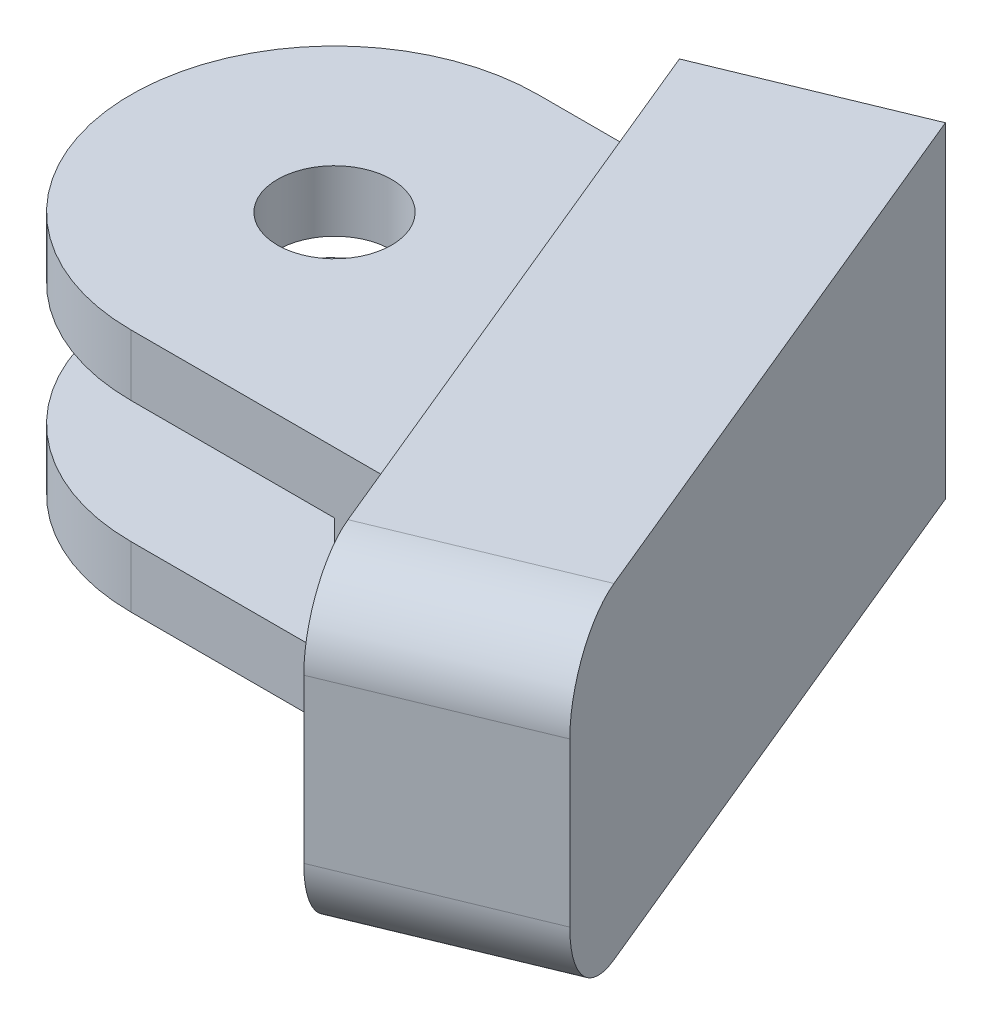
ISO-10303-21;
HEADER;
FILE_DESCRIPTION(('STEP AP214'),'2;1');
FILE_NAME('part.step','',(''),(''),'','','');
FILE_SCHEMA(('AUTOMOTIVE_DESIGN { 1 0 10303 214 1 1 1 1 }'));
ENDSEC;
DATA;
#1=APPLICATION_CONTEXT('core data for automotive mechanical design processes');
#2=APPLICATION_PROTOCOL_DEFINITION('international standard','automotive_design',2000,#1);
#3=PRODUCT_CONTEXT('',#1,'mechanical');
#4=PRODUCT('Part','Part','',(#3));
#5=PRODUCT_RELATED_PRODUCT_CATEGORY('part','',(#4));
#6=PRODUCT_DEFINITION_FORMATION('','',#4);
#7=PRODUCT_DEFINITION_CONTEXT('part definition',#1,'design');
#8=PRODUCT_DEFINITION('design','',#6,#7);
#9=PRODUCT_DEFINITION_SHAPE('','',#8);
#10=(LENGTH_UNIT() NAMED_UNIT(*) SI_UNIT(.MILLI.,.METRE.));
#11=(NAMED_UNIT(*) PLANE_ANGLE_UNIT() SI_UNIT($,.RADIAN.));
#12=(NAMED_UNIT(*) SI_UNIT($,.STERADIAN.) SOLID_ANGLE_UNIT());
#13=UNCERTAINTY_MEASURE_WITH_UNIT(LENGTH_MEASURE(1.E-05),#10,'distance_accuracy_value','');
#14=(GEOMETRIC_REPRESENTATION_CONTEXT(3) GLOBAL_UNCERTAINTY_ASSIGNED_CONTEXT((#13)) GLOBAL_UNIT_ASSIGNED_CONTEXT((#10,
#11,#12)) REPRESENTATION_CONTEXT('',''));
#15=CARTESIAN_POINT('',(0.,0.,0.));
#16=DIRECTION('',(0.,0.,1.));
#17=DIRECTION('',(1.,0.,0.));
#18=AXIS2_PLACEMENT_3D('',#15,#16,#17);
#19=CARTESIAN_POINT('',(0.,0.,0.));
#20=DIRECTION('',(-1.,0.,0.));
#21=DIRECTION('',(0.,0.,1.));
#22=AXIS2_PLACEMENT_3D('',#19,#20,#21);
#23=PLANE('',#22);
#24=DIRECTION('',(0.,0.,-1.));
#25=VECTOR('',#24,1.);
#26=CARTESIAN_POINT('',(0.,1.5,5.));
#27=LINE('',#26,#25);
#28=CARTESIAN_POINT('',(0.,1.5,5.));
#29=VERTEX_POINT('',#28);
#30=CARTESIAN_POINT('',(0.,1.5,3.31662479035541));
#31=VERTEX_POINT('',#30);
#32=EDGE_CURVE('E181',#29,#31,#27,.T.);
#33=ORIENTED_EDGE('',*,*,#32,.T.);
#34=DIRECTION('',(0.,1.,0.));
#35=VECTOR('',#34,1.);
#36=CARTESIAN_POINT('',(0.,-18.4705627484771,3.31662479035541));
#37=LINE('',#36,#35);
#38=CARTESIAN_POINT('',(0.,-1.5,3.31662479035541));
#39=VERTEX_POINT('',#38);
#40=EDGE_CURVE('E174',#31,#39,#37,.F.);
#41=ORIENTED_EDGE('',*,*,#40,.T.);
#42=DIRECTION('',(0.,0.,-1.));
#43=VECTOR('',#42,1.);
#44=CARTESIAN_POINT('',(0.,-1.5,5.));
#45=LINE('',#44,#43);
#46=CARTESIAN_POINT('',(0.,-1.5,5.));
#47=VERTEX_POINT('',#46);
#48=EDGE_CURVE('E172',#47,#39,#45,.T.);
#49=ORIENTED_EDGE('',*,*,#48,.F.);
#50=DIRECTION('',(0.,1.,0.));
#51=VECTOR('',#50,1.);
#52=CARTESIAN_POINT('',(0.,3.,5.));
#53=LINE('',#52,#51);
#54=EDGE_CURVE('E257',#47,#29,#53,.T.);
#55=ORIENTED_EDGE('',*,*,#54,.T.);
#56=EDGE_LOOP('',(#33,#41,#49,#55));
#57=FACE_BOUND('',#56,.T.);
#58=ADVANCED_FACE('F39',(#57),#23,.T.);
#59=CARTESIAN_POINT('',(2.7006271825177,-2.,7.37112643894407));
#60=DIRECTION('',(-0.924244626674477,0.,0.381800825121366));
#61=DIRECTION('',(0.381800825121366,0.,0.924244626674478));
#62=AXIS2_PLACEMENT_3D('',#59,#60,#61);
#63=PLANE('',#62);
#64=DIRECTION('',(0.,1.,0.));
#65=VECTOR('',#64,1.);
#66=CARTESIAN_POINT('',(-3.02638519430278,4.,-6.4925429611731));
#67=LINE('',#66,#65);
#68=CARTESIAN_POINT('',(-3.02638519430278,-4.,-6.4925429611731));
#69=VERTEX_POINT('',#68);
#70=CARTESIAN_POINT('',(-3.02638519430278,4.,-6.4925429611731));
#71=VERTEX_POINT('',#70);
#72=EDGE_CURVE('E296',#69,#71,#67,.T.);
#73=ORIENTED_EDGE('',*,*,#72,.F.);
#74=DIRECTION('',(-0.381800825121366,0.,-0.924244626674477));
#75=VECTOR('',#74,1.);
#76=CARTESIAN_POINT('',(2.7006271825177,-4.,7.37112643894405));
#77=LINE('',#76,#75);
#78=CARTESIAN_POINT('',(2.7006271825177,-4.,7.37112643894405));
#79=VERTEX_POINT('',#78);
#80=EDGE_CURVE('E278',#79,#69,#77,.T.);
#81=ORIENTED_EDGE('',*,*,#80,.F.);
#82=CARTESIAN_POINT('',(2.7006271825177,-2.,7.37112643894407));
#83=DIRECTION('',(0.924244626674477,0.,-0.381800825121366));
#84=DIRECTION('',(0.381800825121366,0.,0.924244626674478));
#85=AXIS2_PLACEMENT_3D('',#82,#83,#84);
#86=CIRCLE('',#85,2.);
#87=CARTESIAN_POINT('',(3.46422883276044,-2.,9.21961569229302));
#88=VERTEX_POINT('',#87);
#89=EDGE_CURVE('E320',#88,#79,#86,.T.);
#90=ORIENTED_EDGE('',*,*,#89,.F.);
#91=DIRECTION('',(0.,-1.,0.));
#92=VECTOR('',#91,1.);
#93=CARTESIAN_POINT('',(3.46422883276044,1.99999999999999,9.21961569229302));
#94=LINE('',#93,#92);
#95=CARTESIAN_POINT('',(3.46422883276044,1.99999999999999,9.21961569229302));
#96=VERTEX_POINT('',#95);
#97=EDGE_CURVE('E324',#96,#88,#94,.T.);
#98=ORIENTED_EDGE('',*,*,#97,.F.);
#99=CARTESIAN_POINT('',(2.70062718251771,2.,7.37112643894407));
#100=DIRECTION('',(0.924244626674477,0.,-0.381800825121366));
#101=DIRECTION('',(0.381800825121366,0.,0.924244626674478));
#102=AXIS2_PLACEMENT_3D('',#99,#100,#101);
#103=CIRCLE('',#102,2.);
#104=CARTESIAN_POINT('',(2.7006271825177,4.,7.37112643894405));
#105=VERTEX_POINT('',#104);
#106=EDGE_CURVE('E328',#105,#96,#103,.T.);
#107=ORIENTED_EDGE('',*,*,#106,.F.);
#108=DIRECTION('',(0.381800825121366,0.,0.924244626674478));
#109=VECTOR('',#108,1.);
#110=CARTESIAN_POINT('',(2.7006271825177,4.,7.37112643894405));
#111=LINE('',#110,#109);
#112=EDGE_CURVE('E332',#71,#105,#111,.T.);
#113=ORIENTED_EDGE('',*,*,#112,.F.);
#114=EDGE_LOOP('',(#73,#81,#90,#98,#107,#113));
#115=FACE_BOUND('',#114,.T.);
#116=DIRECTION('',(0.,1.,0.));
#117=VECTOR('',#116,1.);
#118=CARTESIAN_POINT('',(-2.61949240958185,-18.4705627484771,-5.50755695494487));
#119=LINE('',#118,#117);
#120=CARTESIAN_POINT('',(-2.61949240958185,-1.5,-5.50755695494487));
#121=VERTEX_POINT('',#120);
#122=CARTESIAN_POINT('',(-2.61949240958185,1.5,-5.50755695494487));
#123=VERTEX_POINT('',#122);
#124=EDGE_CURVE('E48',#121,#123,#119,.T.);
#125=ORIENTED_EDGE('',*,*,#124,.T.);
#126=DIRECTION('',(0.381800825121366,0.,0.924244626674478));
#127=VECTOR('',#126,1.);
#128=CARTESIAN_POINT('',(2.7006271825177,1.5,7.37112643894407));
#129=LINE('',#128,#127);
#130=CARTESIAN_POINT('',(-2.40982317418434,1.5,-4.99999999999724));
#131=VERTEX_POINT('',#130);
#132=EDGE_CURVE('E11',#123,#131,#129,.T.);
#133=ORIENTED_EDGE('',*,*,#132,.T.);
#134=DIRECTION('',(0.,-1.,0.));
#135=VECTOR('',#134,1.);
#136=CARTESIAN_POINT('',(-2.40982317418548,0.,-5.));
#137=LINE('',#136,#135);
#138=CARTESIAN_POINT('',(-2.40982317418315,3.,-4.99999999999773));
#139=VERTEX_POINT('',#138);
#140=EDGE_CURVE('E270',#139,#131,#137,.T.);
#141=ORIENTED_EDGE('',*,*,#140,.F.);
#142=DIRECTION('',(-0.381800825121366,0.,-0.924244626674478));
#143=VECTOR('',#142,1.);
#144=CARTESIAN_POINT('',(-72887.9935704214,3.,-176442.83016711));
#145=LINE('',#144,#143);
#146=CARTESIAN_POINT('',(1.72112672912306,3.,4.99999999998352));
#147=VERTEX_POINT('',#146);
#148=EDGE_CURVE('E55',#147,#139,#145,.T.);
#149=ORIENTED_EDGE('',*,*,#148,.F.);
#150=DIRECTION('',(0.,-1.,0.));
#151=VECTOR('',#150,1.);
#152=CARTESIAN_POINT('',(1.72112672914393,0.,5.));
#153=LINE('',#152,#151);
#154=CARTESIAN_POINT('',(1.72112672912306,-3.,4.99999999998352));
#155=VERTEX_POINT('',#154);
#156=EDGE_CURVE('E63',#147,#155,#153,.T.);
#157=ORIENTED_EDGE('',*,*,#156,.T.);
#158=DIRECTION('',(0.381800825121366,0.,0.924244626674478));
#159=VECTOR('',#158,1.);
#160=CARTESIAN_POINT('',(-72887.9935704214,-3.,-176442.83016711));
#161=LINE('',#160,#159);
#162=CARTESIAN_POINT('',(-2.40982317418315,-3.,-4.99999999999773));
#163=VERTEX_POINT('',#162);
#164=EDGE_CURVE('E267',#163,#155,#161,.T.);
#165=ORIENTED_EDGE('',*,*,#164,.F.);
#166=CARTESIAN_POINT('',(-2.40982317418315,-1.5,-4.99999999999773));
#167=VERTEX_POINT('',#166);
#168=EDGE_CURVE('E179',#167,#163,#137,.T.);
#169=ORIENTED_EDGE('',*,*,#168,.F.);
#170=DIRECTION('',(0.381800825121366,0.,0.924244626674478));
#171=VECTOR('',#170,1.);
#172=CARTESIAN_POINT('',(2.7006271825177,-1.5,7.37112643894407));
#173=LINE('',#172,#171);
#174=EDGE_CURVE('E164',#121,#167,#173,.T.);
#175=ORIENTED_EDGE('',*,*,#174,.F.);
#176=EDGE_LOOP('',(#125,#133,#141,#149,#157,#165,#169,#175));
#177=FACE_BOUND('',#176,.T.);
#178=ADVANCED_FACE('F177',(#115,#177),#63,.T.);
#179=CARTESIAN_POINT('',(0.,0.,-5.));
#180=DIRECTION('',(0.,0.,1.));
#181=DIRECTION('',(1.,0.,0.));
#182=AXIS2_PLACEMENT_3D('',#179,#180,#181);
#183=PLANE('',#182);
#184=DIRECTION('',(1.,0.,0.));
#185=VECTOR('',#184,1.);
#186=CARTESIAN_POINT('',(-500000.,3.,-5.));
#187=LINE('',#186,#185);
#188=CARTESIAN_POINT('',(-5.,3.,-5.));
#189=VERTEX_POINT('',#188);
#190=EDGE_CURVE('E189',#189,#139,#187,.T.);
#191=ORIENTED_EDGE('',*,*,#190,.T.);
#192=ORIENTED_EDGE('',*,*,#140,.T.);
#193=DIRECTION('',(1.,0.,0.));
#194=VECTOR('',#193,1.);
#195=CARTESIAN_POINT('',(-500000.,1.5,-5.));
#196=LINE('',#195,#194);
#197=CARTESIAN_POINT('',(-5.,1.5,-5.));
#198=VERTEX_POINT('',#197);
#199=EDGE_CURVE('E192',#198,#131,#196,.T.);
#200=ORIENTED_EDGE('',*,*,#199,.F.);
#201=DIRECTION('',(0.,-1.,0.));
#202=VECTOR('',#201,1.);
#203=CARTESIAN_POINT('',(-5.,3.,-5.));
#204=LINE('',#203,#202);
#205=EDGE_CURVE('E196',#198,#189,#204,.F.);
#206=ORIENTED_EDGE('',*,*,#205,.T.);
#207=EDGE_LOOP('',(#191,#192,#200,#206));
#208=FACE_BOUND('',#207,.T.);
#209=ADVANCED_FACE('F359',(#208),#183,.F.);
#210=CARTESIAN_POINT('',(-5.,3.,0.));
#211=DIRECTION('',(0.,-1.,0.));
#212=DIRECTION('',(0.,0.,-1.));
#213=AXIS2_PLACEMENT_3D('',#210,#211,#212);
#214=CYLINDRICAL_SURFACE('',#213,5.);
#215=DIRECTION('',(0.,-1.,0.));
#216=VECTOR('',#215,1.);
#217=CARTESIAN_POINT('',(-5.,3.,5.));
#218=LINE('',#217,#216);
#219=CARTESIAN_POINT('',(-5.,1.5,5.));
#220=VERTEX_POINT('',#219);
#221=CARTESIAN_POINT('',(-5.,3.,5.));
#222=VERTEX_POINT('',#221);
#223=EDGE_CURVE('E212',#220,#222,#218,.F.);
#224=ORIENTED_EDGE('',*,*,#223,.T.);
#225=CARTESIAN_POINT('',(-5.,3.,0.));
#226=DIRECTION('',(0.,1.,0.));
#227=DIRECTION('',(0.,0.,1.));
#228=AXIS2_PLACEMENT_3D('',#225,#226,#227);
#229=CIRCLE('',#228,5.);
#230=EDGE_CURVE('E200',#189,#222,#229,.T.);
#231=ORIENTED_EDGE('',*,*,#230,.F.);
#232=ORIENTED_EDGE('',*,*,#205,.F.);
#233=CARTESIAN_POINT('',(-5.,1.5,0.));
#234=DIRECTION('',(0.,1.,0.));
#235=DIRECTION('',(0.,0.,1.));
#236=AXIS2_PLACEMENT_3D('',#233,#234,#235);
#237=CIRCLE('',#236,5.);
#238=EDGE_CURVE('E201',#198,#220,#237,.T.);
#239=ORIENTED_EDGE('',*,*,#238,.T.);
#240=EDGE_LOOP('',(#224,#231,#232,#239));
#241=FACE_BOUND('',#240,.T.);
#242=ADVANCED_FACE('F356',(#241),#214,.T.);
#243=CARTESIAN_POINT('',(0.,0.,5.));
#244=DIRECTION('',(0.,0.,1.));
#245=DIRECTION('',(1.,0.,0.));
#246=AXIS2_PLACEMENT_3D('',#243,#244,#245);
#247=PLANE('',#246);
#248=ORIENTED_EDGE('',*,*,#156,.F.);
#249=DIRECTION('',(1.,0.,0.));
#250=VECTOR('',#249,1.);
#251=CARTESIAN_POINT('',(-500000.,3.,5.));
#252=LINE('',#251,#250);
#253=EDGE_CURVE('E219',#222,#147,#252,.T.);
#254=ORIENTED_EDGE('',*,*,#253,.F.);
#255=ORIENTED_EDGE('',*,*,#223,.F.);
#256=DIRECTION('',(1.,0.,0.));
#257=VECTOR('',#256,1.);
#258=CARTESIAN_POINT('',(-500000.,1.5,5.));
#259=LINE('',#258,#257);
#260=EDGE_CURVE('E216',#220,#29,#259,.T.);
#261=ORIENTED_EDGE('',*,*,#260,.T.);
#262=ORIENTED_EDGE('',*,*,#54,.F.);
#263=DIRECTION('',(1.,0.,0.));
#264=VECTOR('',#263,1.);
#265=CARTESIAN_POINT('',(-500000.,-1.5,5.));
#266=LINE('',#265,#264);
#267=CARTESIAN_POINT('',(-5.,-1.5,5.));
#268=VERTEX_POINT('',#267);
#269=EDGE_CURVE('E254',#268,#47,#266,.T.);
#270=ORIENTED_EDGE('',*,*,#269,.F.);
#271=DIRECTION('',(0.,1.,0.));
#272=VECTOR('',#271,1.);
#273=CARTESIAN_POINT('',(-5.,-3.,5.));
#274=LINE('',#273,#272);
#275=CARTESIAN_POINT('',(-5.,-3.,5.));
#276=VERTEX_POINT('',#275);
#277=EDGE_CURVE('E247',#276,#268,#274,.T.);
#278=ORIENTED_EDGE('',*,*,#277,.F.);
#279=DIRECTION('',(1.,0.,0.));
#280=VECTOR('',#279,1.);
#281=CARTESIAN_POINT('',(-500000.,-3.,5.));
#282=LINE('',#281,#280);
#283=EDGE_CURVE('E251',#276,#155,#282,.T.);
#284=ORIENTED_EDGE('',*,*,#283,.T.);
#285=EDGE_LOOP('',(#248,#254,#255,#261,#262,#270,#278,#284));
#286=FACE_BOUND('',#285,.T.);
#287=ADVANCED_FACE('F350',(#286),#247,.T.);
#288=DIRECTION('',(1.,0.,0.));
#289=VECTOR('',#288,1.);
#290=CARTESIAN_POINT('',(-500000.,-1.5,-5.));
#291=LINE('',#290,#289);
#292=CARTESIAN_POINT('',(-5.,-1.5,-5.));
#293=VERTEX_POINT('',#292);
#294=EDGE_CURVE('E222',#293,#167,#291,.T.);
#295=ORIENTED_EDGE('',*,*,#294,.T.);
#296=ORIENTED_EDGE('',*,*,#168,.T.);
#297=DIRECTION('',(1.,0.,0.));
#298=VECTOR('',#297,1.);
#299=CARTESIAN_POINT('',(-500000.,-3.,-5.));
#300=LINE('',#299,#298);
#301=CARTESIAN_POINT('',(-5.,-3.,-5.));
#302=VERTEX_POINT('',#301);
#303=EDGE_CURVE('E227',#302,#163,#300,.T.);
#304=ORIENTED_EDGE('',*,*,#303,.F.);
#305=DIRECTION('',(0.,1.,0.));
#306=VECTOR('',#305,1.);
#307=CARTESIAN_POINT('',(-5.,-3.,-5.));
#308=LINE('',#307,#306);
#309=EDGE_CURVE('E231',#302,#293,#308,.T.);
#310=ORIENTED_EDGE('',*,*,#309,.T.);
#311=EDGE_LOOP('',(#295,#296,#304,#310));
#312=FACE_BOUND('',#311,.T.);
#313=ADVANCED_FACE('F41',(#312),#183,.F.);
#314=CARTESIAN_POINT('',(-500000.,3.,-5.));
#315=DIRECTION('',(0.,-1.,0.));
#316=DIRECTION('',(0.,0.,-1.));
#317=AXIS2_PLACEMENT_3D('',#314,#315,#316);
#318=PLANE('',#317);
#319=ORIENTED_EDGE('',*,*,#253,.T.);
#320=ORIENTED_EDGE('',*,*,#148,.T.);
#321=ORIENTED_EDGE('',*,*,#190,.F.);
#322=ORIENTED_EDGE('',*,*,#230,.T.);
#323=EDGE_LOOP('',(#319,#320,#321,#322));
#324=FACE_BOUND('',#323,.T.);
#325=CARTESIAN_POINT('',(-5.,3.,0.));
#326=DIRECTION('',(0.,1.,0.));
#327=DIRECTION('',(0.,0.,1.));
#328=AXIS2_PLACEMENT_3D('',#325,#326,#327);
#329=CIRCLE('',#328,1.4);
#330=CARTESIAN_POINT('',(-5.,3.,1.4));
#331=VERTEX_POINT('',#330);
#332=EDGE_CURVE('E204',#331,#331,#329,.T.);
#333=ORIENTED_EDGE('',*,*,#332,.F.);
#334=EDGE_LOOP('',(#333));
#335=FACE_BOUND('',#334,.T.);
#336=ADVANCED_FACE('F372',(#324,#335),#318,.F.);
#337=CARTESIAN_POINT('',(-500000.,1.5,-5.));
#338=DIRECTION('',(0.,1.,0.));
#339=DIRECTION('',(0.,0.,1.));
#340=AXIS2_PLACEMENT_3D('',#337,#338,#339);
#341=PLANE('',#340);
#342=ORIENTED_EDGE('',*,*,#32,.F.);
#343=ORIENTED_EDGE('',*,*,#260,.F.);
#344=ORIENTED_EDGE('',*,*,#238,.F.);
#345=ORIENTED_EDGE('',*,*,#199,.T.);
#346=ORIENTED_EDGE('',*,*,#132,.F.);
#347=CARTESIAN_POINT('',(-5.,1.5,0.));
#348=DIRECTION('',(0.,-1.,0.));
#349=DIRECTION('',(0.,0.,-1.));
#350=AXIS2_PLACEMENT_3D('',#347,#348,#349);
#351=CIRCLE('',#350,6.);
#352=EDGE_CURVE('E160',#123,#31,#351,.T.);
#353=ORIENTED_EDGE('',*,*,#352,.T.);
#354=EDGE_LOOP('',(#342,#343,#344,#345,#346,#353));
#355=FACE_BOUND('',#354,.T.);
#356=CARTESIAN_POINT('',(-5.,1.5,0.));
#357=DIRECTION('',(0.,1.,0.));
#358=DIRECTION('',(0.,0.,1.));
#359=AXIS2_PLACEMENT_3D('',#356,#357,#358);
#360=CIRCLE('',#359,1.4);
#361=CARTESIAN_POINT('',(-5.,1.5,1.4));
#362=VERTEX_POINT('',#361);
#363=EDGE_CURVE('E208',#362,#362,#360,.T.);
#364=ORIENTED_EDGE('',*,*,#363,.T.);
#365=EDGE_LOOP('',(#364));
#366=FACE_BOUND('',#365,.T.);
#367=ADVANCED_FACE('F344',(#355,#366),#341,.F.);
#368=CARTESIAN_POINT('',(-5.,3.,0.));
#369=DIRECTION('',(0.,-1.,0.));
#370=DIRECTION('',(0.,0.,-1.));
#371=AXIS2_PLACEMENT_3D('',#368,#369,#370);
#372=CYLINDRICAL_SURFACE('',#371,1.4);
#373=ORIENTED_EDGE('',*,*,#332,.T.);
#374=EDGE_LOOP('',(#373));
#375=FACE_BOUND('',#374,.T.);
#376=ORIENTED_EDGE('',*,*,#363,.F.);
#377=EDGE_LOOP('',(#376));
#378=FACE_BOUND('',#377,.T.);
#379=ADVANCED_FACE('F399',(#375,#378),#372,.F.);
#380=CARTESIAN_POINT('',(-500000.,-1.5,-5.));
#381=DIRECTION('',(0.,-1.,0.));
#382=DIRECTION('',(0.,0.,-1.));
#383=AXIS2_PLACEMENT_3D('',#380,#381,#382);
#384=PLANE('',#383);
#385=ORIENTED_EDGE('',*,*,#48,.T.);
#386=CARTESIAN_POINT('',(-5.,-1.5,0.));
#387=DIRECTION('',(0.,-1.,0.));
#388=DIRECTION('',(0.,0.,-1.));
#389=AXIS2_PLACEMENT_3D('',#386,#387,#388);
#390=CIRCLE('',#389,6.);
#391=EDGE_CURVE('E157',#121,#39,#390,.T.);
#392=ORIENTED_EDGE('',*,*,#391,.F.);
#393=ORIENTED_EDGE('',*,*,#174,.T.);
#394=ORIENTED_EDGE('',*,*,#294,.F.);
#395=CARTESIAN_POINT('',(-5.,-1.5,0.));
#396=DIRECTION('',(0.,1.,0.));
#397=DIRECTION('',(0.,0.,1.));
#398=AXIS2_PLACEMENT_3D('',#395,#396,#397);
#399=CIRCLE('',#398,5.);
#400=EDGE_CURVE('E236',#293,#268,#399,.T.);
#401=ORIENTED_EDGE('',*,*,#400,.T.);
#402=ORIENTED_EDGE('',*,*,#269,.T.);
#403=EDGE_LOOP('',(#385,#392,#393,#394,#401,#402));
#404=FACE_BOUND('',#403,.T.);
#405=CARTESIAN_POINT('',(-5.,-1.5,0.));
#406=DIRECTION('',(0.,1.,0.));
#407=DIRECTION('',(0.,0.,1.));
#408=AXIS2_PLACEMENT_3D('',#405,#406,#407);
#409=CIRCLE('',#408,1.4);
#410=CARTESIAN_POINT('',(-5.,-1.5,1.4));
#411=VERTEX_POINT('',#410);
#412=EDGE_CURVE('E243',#411,#411,#409,.T.);
#413=ORIENTED_EDGE('',*,*,#412,.F.);
#414=EDGE_LOOP('',(#413));
#415=FACE_BOUND('',#414,.T.);
#416=ADVANCED_FACE('F167',(#404,#415),#384,.F.);
#417=CARTESIAN_POINT('',(-500000.,-3.,-5.));
#418=DIRECTION('',(0.,1.,0.));
#419=DIRECTION('',(0.,0.,1.));
#420=AXIS2_PLACEMENT_3D('',#417,#418,#419);
#421=PLANE('',#420);
#422=ORIENTED_EDGE('',*,*,#303,.T.);
#423=ORIENTED_EDGE('',*,*,#164,.T.);
#424=ORIENTED_EDGE('',*,*,#283,.F.);
#425=CARTESIAN_POINT('',(-5.,-3.,0.));
#426=DIRECTION('',(0.,1.,0.));
#427=DIRECTION('',(0.,0.,1.));
#428=AXIS2_PLACEMENT_3D('',#425,#426,#427);
#429=CIRCLE('',#428,5.);
#430=EDGE_CURVE('E235',#302,#276,#429,.T.);
#431=ORIENTED_EDGE('',*,*,#430,.F.);
#432=EDGE_LOOP('',(#422,#423,#424,#431));
#433=FACE_BOUND('',#432,.T.);
#434=CARTESIAN_POINT('',(-5.,-3.,0.));
#435=DIRECTION('',(0.,1.,0.));
#436=DIRECTION('',(0.,0.,1.));
#437=AXIS2_PLACEMENT_3D('',#434,#435,#436);
#438=CIRCLE('',#437,1.4);
#439=CARTESIAN_POINT('',(-5.,-3.,1.4));
#440=VERTEX_POINT('',#439);
#441=EDGE_CURVE('E240',#440,#440,#438,.T.);
#442=ORIENTED_EDGE('',*,*,#441,.T.);
#443=EDGE_LOOP('',(#442));
#444=FACE_BOUND('',#443,.T.);
#445=ADVANCED_FACE('F364',(#433,#444),#421,.F.);
#446=CARTESIAN_POINT('',(-5.,-3.,0.));
#447=DIRECTION('',(0.,1.,0.));
#448=DIRECTION('',(0.,0.,1.));
#449=AXIS2_PLACEMENT_3D('',#446,#447,#448);
#450=CYLINDRICAL_SURFACE('',#449,5.);
#451=ORIENTED_EDGE('',*,*,#277,.T.);
#452=ORIENTED_EDGE('',*,*,#400,.F.);
#453=ORIENTED_EDGE('',*,*,#309,.F.);
#454=ORIENTED_EDGE('',*,*,#430,.T.);
#455=EDGE_LOOP('',(#451,#452,#453,#454));
#456=FACE_BOUND('',#455,.T.);
#457=ADVANCED_FACE('F368',(#456),#450,.T.);
#458=CARTESIAN_POINT('',(-5.,-3.,0.));
#459=DIRECTION('',(0.,1.,0.));
#460=DIRECTION('',(0.,0.,1.));
#461=AXIS2_PLACEMENT_3D('',#458,#459,#460);
#462=CYLINDRICAL_SURFACE('',#461,1.4);
#463=ORIENTED_EDGE('',*,*,#441,.F.);
#464=EDGE_LOOP('',(#463));
#465=FACE_BOUND('',#464,.T.);
#466=ORIENTED_EDGE('',*,*,#412,.T.);
#467=EDGE_LOOP('',(#466));
#468=FACE_BOUND('',#467,.T.);
#469=ADVANCED_FACE('F390',(#465,#468),#462,.F.);
#470=CARTESIAN_POINT('',(-3.02638519430278,4.,-6.4925429611731));
#471=DIRECTION('',(-0.381800825121366,0.,-0.924244626674477));
#472=DIRECTION('',(-0.924244626674478,0.,0.381800825121366));
#473=AXIS2_PLACEMENT_3D('',#470,#471,#472);
#474=PLANE('',#473);
#475=DIRECTION('',(0.,1.,0.));
#476=VECTOR('',#475,1.);
#477=CARTESIAN_POINT('',(1.59483793906961,4.,-8.40154708677993));
#478=LINE('',#477,#476);
#479=CARTESIAN_POINT('',(1.59483793906961,-4.,-8.40154708677993));
#480=VERTEX_POINT('',#479);
#481=CARTESIAN_POINT('',(1.59483793906961,4.,-8.40154708677993));
#482=VERTEX_POINT('',#481);
#483=EDGE_CURVE('E313',#480,#482,#478,.T.);
#484=ORIENTED_EDGE('',*,*,#483,.F.);
#485=DIRECTION('',(0.924244626674477,0.,-0.381800825121366));
#486=VECTOR('',#485,1.);
#487=CARTESIAN_POINT('',(-3.02638519430278,-4.,-6.4925429611731));
#488=LINE('',#487,#486);
#489=EDGE_CURVE('E273',#69,#480,#488,.T.);
#490=ORIENTED_EDGE('',*,*,#489,.F.);
#491=ORIENTED_EDGE('',*,*,#72,.T.);
#492=DIRECTION('',(0.924244626674477,0.,-0.381800825121366));
#493=VECTOR('',#492,1.);
#494=CARTESIAN_POINT('',(-3.02638519430278,4.,-6.4925429611731));
#495=LINE('',#494,#493);
#496=EDGE_CURVE('E274',#71,#482,#495,.T.);
#497=ORIENTED_EDGE('',*,*,#496,.T.);
#498=EDGE_LOOP('',(#484,#490,#491,#497));
#499=FACE_BOUND('',#498,.T.);
#500=ADVANCED_FACE('F393',(#499),#474,.T.);
#501=CARTESIAN_POINT('',(2.7006271825177,-4.,7.37112643894405));
#502=DIRECTION('',(0.,-1.,0.));
#503=DIRECTION('',(0.,0.,-1.));
#504=AXIS2_PLACEMENT_3D('',#501,#502,#503);
#505=PLANE('',#504);
#506=DIRECTION('',(-0.381800825121366,0.,-0.924244626674477));
#507=VECTOR('',#506,1.);
#508=CARTESIAN_POINT('',(7.32185031589009,-4.,5.46212231333722));
#509=LINE('',#508,#507);
#510=CARTESIAN_POINT('',(7.32185031589009,-4.,5.46212231333722));
#511=VERTEX_POINT('',#510);
#512=EDGE_CURVE('E292',#511,#480,#509,.T.);
#513=ORIENTED_EDGE('',*,*,#512,.F.);
#514=DIRECTION('',(0.924244626674477,0.,-0.381800825121366));
#515=VECTOR('',#514,1.);
#516=CARTESIAN_POINT('',(2.7006271825177,-4.,7.37112643894405));
#517=LINE('',#516,#515);
#518=EDGE_CURVE('E287',#79,#511,#517,.T.);
#519=ORIENTED_EDGE('',*,*,#518,.F.);
#520=ORIENTED_EDGE('',*,*,#80,.T.);
#521=ORIENTED_EDGE('',*,*,#489,.T.);
#522=EDGE_LOOP('',(#513,#519,#520,#521));
#523=FACE_BOUND('',#522,.T.);
#524=ADVANCED_FACE('F440',(#523),#505,.T.);
#525=CARTESIAN_POINT('',(2.7006271825177,-2.,7.37112643894407));
#526=DIRECTION('',(0.924244626674477,0.,-0.381800825121366));
#527=DIRECTION('',(-0.381800825121366,0.,-0.924244626674478));
#528=AXIS2_PLACEMENT_3D('',#525,#526,#527);
#529=CYLINDRICAL_SURFACE('',#528,2.);
#530=CARTESIAN_POINT('',(7.32185031589009,-2.,5.46212231333724));
#531=DIRECTION('',(0.924244626674477,0.,-0.381800825121366));
#532=DIRECTION('',(0.381800825121366,0.,0.924244626674478));
#533=AXIS2_PLACEMENT_3D('',#530,#531,#532);
#534=CIRCLE('',#533,2.);
#535=CARTESIAN_POINT('',(8.08545196613282,-2.,7.31061156668619));
#536=VERTEX_POINT('',#535);
#537=EDGE_CURVE('E297',#536,#511,#534,.T.);
#538=ORIENTED_EDGE('',*,*,#537,.F.);
#539=DIRECTION('',(0.924244626674477,0.,-0.381800825121366));
#540=VECTOR('',#539,1.);
#541=CARTESIAN_POINT('',(3.46422883276044,-2.,9.21961569229302));
#542=LINE('',#541,#540);
#543=EDGE_CURVE('E284',#88,#536,#542,.T.);
#544=ORIENTED_EDGE('',*,*,#543,.F.);
#545=ORIENTED_EDGE('',*,*,#89,.T.);
#546=ORIENTED_EDGE('',*,*,#518,.T.);
#547=EDGE_LOOP('',(#538,#544,#545,#546));
#548=FACE_BOUND('',#547,.T.);
#549=ADVANCED_FACE('F447',(#548),#529,.T.);
#550=CARTESIAN_POINT('',(3.46422883276044,1.99999999999999,9.21961569229302));
#551=DIRECTION('',(0.381800825121366,0.,0.924244626674477));
#552=DIRECTION('',(0.924244626674478,0.,-0.381800825121366));
#553=AXIS2_PLACEMENT_3D('',#550,#551,#552);
#554=PLANE('',#553);
#555=DIRECTION('',(0.,-1.,0.));
#556=VECTOR('',#555,1.);
#557=CARTESIAN_POINT('',(8.08545196613282,1.99999999999999,7.31061156668619));
#558=LINE('',#557,#556);
#559=CARTESIAN_POINT('',(8.08545196613282,1.99999999999999,7.31061156668619));
#560=VERTEX_POINT('',#559);
#561=EDGE_CURVE('E301',#560,#536,#558,.T.);
#562=ORIENTED_EDGE('',*,*,#561,.F.);
#563=DIRECTION('',(0.924244626674477,0.,-0.381800825121366));
#564=VECTOR('',#563,1.);
#565=CARTESIAN_POINT('',(3.46422883276044,1.99999999999999,9.21961569229302));
#566=LINE('',#565,#564);
#567=EDGE_CURVE('E281',#96,#560,#566,.T.);
#568=ORIENTED_EDGE('',*,*,#567,.F.);
#569=ORIENTED_EDGE('',*,*,#97,.T.);
#570=ORIENTED_EDGE('',*,*,#543,.T.);
#571=EDGE_LOOP('',(#562,#568,#569,#570));
#572=FACE_BOUND('',#571,.T.);
#573=ADVANCED_FACE('F455',(#572),#554,.T.);
#574=CARTESIAN_POINT('',(2.70062718251771,2.,7.37112643894407));
#575=DIRECTION('',(0.924244626674477,0.,-0.381800825121366));
#576=DIRECTION('',(-0.381800825121366,0.,-0.924244626674478));
#577=AXIS2_PLACEMENT_3D('',#574,#575,#576);
#578=CYLINDRICAL_SURFACE('',#577,2.);
#579=CARTESIAN_POINT('',(7.32185031589009,2.,5.46212231333724));
#580=DIRECTION('',(0.924244626674477,0.,-0.381800825121366));
#581=DIRECTION('',(0.381800825121366,0.,0.924244626674478));
#582=AXIS2_PLACEMENT_3D('',#579,#580,#581);
#583=CIRCLE('',#582,2.);
#584=CARTESIAN_POINT('',(7.32185031589009,4.,5.46212231333722));
#585=VERTEX_POINT('',#584);
#586=EDGE_CURVE('E305',#585,#560,#583,.T.);
#587=ORIENTED_EDGE('',*,*,#586,.F.);
#588=DIRECTION('',(0.924244626674477,0.,-0.381800825121366));
#589=VECTOR('',#588,1.);
#590=CARTESIAN_POINT('',(2.7006271825177,4.,7.37112643894405));
#591=LINE('',#590,#589);
#592=EDGE_CURVE('E277',#105,#585,#591,.T.);
#593=ORIENTED_EDGE('',*,*,#592,.F.);
#594=ORIENTED_EDGE('',*,*,#106,.T.);
#595=ORIENTED_EDGE('',*,*,#567,.T.);
#596=EDGE_LOOP('',(#587,#593,#594,#595));
#597=FACE_BOUND('',#596,.T.);
#598=ADVANCED_FACE('F463',(#597),#578,.T.);
#599=CARTESIAN_POINT('',(2.7006271825177,4.,7.37112643894405));
#600=DIRECTION('',(0.,1.,0.));
#601=DIRECTION('',(0.,0.,1.));
#602=AXIS2_PLACEMENT_3D('',#599,#600,#601);
#603=PLANE('',#602);
#604=DIRECTION('',(0.381800825121366,0.,0.924244626674478));
#605=VECTOR('',#604,1.);
#606=CARTESIAN_POINT('',(7.32185031589009,4.,5.46212231333723));
#607=LINE('',#606,#605);
#608=EDGE_CURVE('E309',#482,#585,#607,.T.);
#609=ORIENTED_EDGE('',*,*,#608,.F.);
#610=ORIENTED_EDGE('',*,*,#496,.F.);
#611=ORIENTED_EDGE('',*,*,#112,.T.);
#612=ORIENTED_EDGE('',*,*,#592,.T.);
#613=EDGE_LOOP('',(#609,#610,#611,#612));
#614=FACE_BOUND('',#613,.T.);
#615=ADVANCED_FACE('F471',(#614),#603,.T.);
#616=CARTESIAN_POINT('',(3.,8.,-5.));
#617=DIRECTION('',(-0.924244626674478,0.,0.381800825121366));
#618=DIRECTION('',(0.381800825121366,0.,0.924244626674478));
#619=AXIS2_PLACEMENT_3D('',#616,#617,#618);
#620=PLANE('',#619);
#621=ORIENTED_EDGE('',*,*,#483,.T.);
#622=ORIENTED_EDGE('',*,*,#608,.T.);
#623=ORIENTED_EDGE('',*,*,#586,.T.);
#624=ORIENTED_EDGE('',*,*,#561,.T.);
#625=ORIENTED_EDGE('',*,*,#537,.T.);
#626=ORIENTED_EDGE('',*,*,#512,.T.);
#627=EDGE_LOOP('',(#621,#622,#623,#624,#625,#626));
#628=FACE_BOUND('',#627,.T.);
#629=ADVANCED_FACE('F388',(#628),#620,.F.);
#630=CARTESIAN_POINT('',(-5.,-18.4705627484771,0.));
#631=DIRECTION('',(0.,1.,0.));
#632=DIRECTION('',(0.,0.,1.));
#633=AXIS2_PLACEMENT_3D('',#630,#631,#632);
#634=CYLINDRICAL_SURFACE('',#633,6.);
#635=ORIENTED_EDGE('',*,*,#352,.F.);
#636=ORIENTED_EDGE('',*,*,#124,.F.);
#637=ORIENTED_EDGE('',*,*,#391,.T.);
#638=ORIENTED_EDGE('',*,*,#40,.F.);
#639=EDGE_LOOP('',(#635,#636,#637,#638));
#640=FACE_BOUND('',#639,.T.);
#641=ADVANCED_FACE('F156',(#640),#634,.F.);
#642=CLOSED_SHELL('',(#58,#178,#209,#242,#287,#313,#336,#367,#379,#416,#445,#457,#469,#500,#524,
#549,#573,#598,#615,#629,#641));
#643=MANIFOLD_SOLID_BREP('B2',#642);
#644=ADVANCED_BREP_SHAPE_REPRESENTATION('',(#18,#643),#14);
#645=SHAPE_DEFINITION_REPRESENTATION(#9,#644);
ENDSEC;
END-ISO-10303-21;
